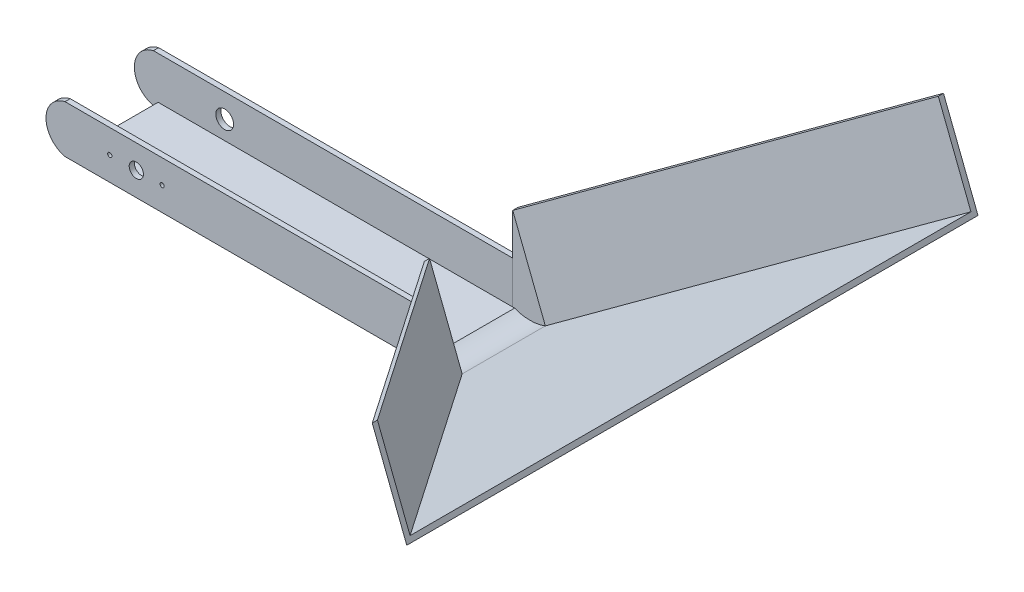
ISO-10303-21;
HEADER;
FILE_DESCRIPTION(('STEP AP214'),'2;1');
FILE_NAME('part.step','',(''),(''),'','','');
FILE_SCHEMA(('AUTOMOTIVE_DESIGN { 1 0 10303 214 1 1 1 1 }'));
ENDSEC;
DATA;
#1=APPLICATION_CONTEXT('core data for automotive mechanical design processes');
#2=APPLICATION_PROTOCOL_DEFINITION('international standard','automotive_design',2000,#1);
#3=PRODUCT_CONTEXT('',#1,'mechanical');
#4=PRODUCT('Part','Part','',(#3));
#5=PRODUCT_RELATED_PRODUCT_CATEGORY('part','',(#4));
#6=PRODUCT_DEFINITION_FORMATION('','',#4);
#7=PRODUCT_DEFINITION_CONTEXT('part definition',#1,'design');
#8=PRODUCT_DEFINITION('design','',#6,#7);
#9=PRODUCT_DEFINITION_SHAPE('','',#8);
#10=(LENGTH_UNIT() NAMED_UNIT(*) SI_UNIT(.MILLI.,.METRE.));
#11=(NAMED_UNIT(*) PLANE_ANGLE_UNIT() SI_UNIT($,.RADIAN.));
#12=(NAMED_UNIT(*) SI_UNIT($,.STERADIAN.) SOLID_ANGLE_UNIT());
#13=UNCERTAINTY_MEASURE_WITH_UNIT(LENGTH_MEASURE(1.E-05),#10,'distance_accuracy_value','');
#14=(GEOMETRIC_REPRESENTATION_CONTEXT(3) GLOBAL_UNCERTAINTY_ASSIGNED_CONTEXT((#13)) GLOBAL_UNIT_ASSIGNED_CONTEXT((#10,
#11,#12)) REPRESENTATION_CONTEXT('',''));
#15=CARTESIAN_POINT('',(0.,0.,0.));
#16=DIRECTION('',(0.,0.,1.));
#17=DIRECTION('',(1.,0.,0.));
#18=AXIS2_PLACEMENT_3D('',#15,#16,#17);
#19=CARTESIAN_POINT('',(99.0163790398225,18.6607266862626,28.6585677660098));
#20=DIRECTION('',(-0.363086708097829,0.931755355446204,0.));
#21=DIRECTION('',(0.931755355446204,0.363086708097829,0.));
#22=AXIS2_PLACEMENT_3D('',#19,#20,#21);
#23=PLANE('',#22);
#24=DIRECTION('',(-0.598920797739893,-0.233387637207156,-0.766044443118982));
#25=VECTOR('',#24,1.);
#26=CARTESIAN_POINT('',(99.0163790398225,18.6607266862626,28.6585677660098));
#27=LINE('',#26,#25);
#28=CARTESIAN_POINT('',(198.805962668012,57.5467617492555,156.293567766011));
#29=VERTEX_POINT('',#28);
#30=CARTESIAN_POINT('',(99.0163790398225,18.6607266862626,28.6585677660097));
#31=VERTEX_POINT('',#30);
#32=EDGE_CURVE('E106',#29,#31,#27,.T.);
#33=ORIENTED_EDGE('',*,*,#32,.T.);
#34=DIRECTION('',(0.,0.,1.));
#35=VECTOR('',#34,1.);
#36=CARTESIAN_POINT('',(99.0163790398225,18.6607266862627,-72.5875588624848));
#37=LINE('',#36,#35);
#38=CARTESIAN_POINT('',(99.0163790398225,18.6607266862626,31.4271677660097));
#39=VERTEX_POINT('',#38);
#40=EDGE_CURVE('E191',#31,#39,#37,.T.);
#41=ORIENTED_EDGE('',*,*,#40,.T.);
#42=DIRECTION('',(0.598920797739893,0.233387637207156,0.766044443118982));
#43=VECTOR('',#42,1.);
#44=CARTESIAN_POINT('',(97.7461455010847,18.1657416975529,29.8024865936655));
#45=LINE('',#44,#43);
#46=CARTESIAN_POINT('',(198.805962668012,57.5467617492555,159.062167766011));
#47=VERTEX_POINT('',#46);
#48=EDGE_CURVE('E108',#39,#47,#45,.T.);
#49=ORIENTED_EDGE('',*,*,#48,.T.);
#50=DIRECTION('',(0.,0.,-1.));
#51=VECTOR('',#50,1.);
#52=CARTESIAN_POINT('',(198.805962668012,57.5467617492555,28.6585677660098));
#53=LINE('',#52,#51);
#54=EDGE_CURVE('E70',#47,#29,#53,.T.);
#55=ORIENTED_EDGE('',*,*,#54,.T.);
#56=EDGE_LOOP('',(#33,#41,#49,#55));
#57=FACE_BOUND('',#56,.T.);
#58=ADVANCED_FACE('F46',(#57),#23,.T.);
#59=CARTESIAN_POINT('',(117.461183811192,-28.6724453704045,28.6585677660098));
#60=DIRECTION('',(-0.363086708097829,0.931755355446204,0.));
#61=DIRECTION('',(0.931755355446204,0.363086708097829,0.));
#62=AXIS2_PLACEMENT_3D('',#59,#60,#61);
#63=PLANE('',#62);
#64=DIRECTION('',(0.598920797739893,0.233387637207156,0.766044443118982));
#65=VECTOR('',#64,1.);
#66=CARTESIAN_POINT('',(116.190950272454,-29.1674303591143,29.8024865936655));
#67=LINE('',#66,#65);
#68=CARTESIAN_POINT('',(117.461183811192,-28.6724453704045,31.4271677660098));
#69=VERTEX_POINT('',#68);
#70=CARTESIAN_POINT('',(217.250767439382,10.2135896925883,159.062167766011));
#71=VERTEX_POINT('',#70);
#72=EDGE_CURVE('E83',#69,#71,#67,.T.);
#73=ORIENTED_EDGE('',*,*,#72,.F.);
#74=DIRECTION('',(0.,0.,1.));
#75=VECTOR('',#74,1.);
#76=CARTESIAN_POINT('',(117.461183811192,-28.6724453704045,28.6585677660098));
#77=LINE('',#76,#75);
#78=CARTESIAN_POINT('',(117.461183811192,-28.6724453704045,-18.5600322339902));
#79=VERTEX_POINT('',#78);
#80=EDGE_CURVE('E93',#79,#69,#77,.T.);
#81=ORIENTED_EDGE('',*,*,#80,.F.);
#82=DIRECTION('',(-0.598920797739899,-0.233387637207158,0.766044443118977));
#83=VECTOR('',#82,1.);
#84=CARTESIAN_POINT('',(95.7972925404252,-37.1144370585824,9.1489796870016));
#85=LINE('',#84,#83);
#86=CARTESIAN_POINT('',(217.250767439382,10.2135896925884,-146.195032233989));
#87=VERTEX_POINT('',#86);
#88=EDGE_CURVE('E105',#87,#79,#85,.T.);
#89=ORIENTED_EDGE('',*,*,#88,.F.);
#90=DIRECTION('',(0.,0.,-1.));
#91=VECTOR('',#90,1.);
#92=CARTESIAN_POINT('',(217.250767439382,10.2135896925884,28.6585677660098));
#93=LINE('',#92,#91);
#94=EDGE_CURVE('E92',#71,#87,#93,.T.);
#95=ORIENTED_EDGE('',*,*,#94,.F.);
#96=EDGE_LOOP('',(#73,#81,#89,#95));
#97=FACE_BOUND('',#96,.T.);
#98=ADVANCED_FACE('F103',(#97),#63,.F.);
#99=CARTESIAN_POINT('',(75.3497930114889,9.4383243005778,28.6585677660097));
#100=DIRECTION('',(0.,0.,-1.));
#101=DIRECTION('',(-0.931755355446204,-0.363086708097829,0.));
#102=AXIS2_PLACEMENT_3D('',#99,#100,#101);
#103=PLANE('',#102);
#104=DIRECTION('',(-0.363087079020477,-0.93175521090487,0.));
#105=VECTOR('',#104,1.);
#106=CARTESIAN_POINT('',(99.0163790398225,-28.6724175217377,28.6585677660097));
#107=LINE('',#106,#105);
#108=CARTESIAN_POINT('',(100.029467360769,-26.0726270673509,28.6585677660097));
#109=VERTEX_POINT('',#108);
#110=CARTESIAN_POINT('',(99.0163790398225,-28.6724175217377,28.6585677660097));
#111=VERTEX_POINT('',#110);
#112=EDGE_CURVE('E179',#109,#111,#107,.T.);
#113=ORIENTED_EDGE('',*,*,#112,.T.);
#114=DIRECTION('',(0.,1.,0.));
#115=VECTOR('',#114,1.);
#116=CARTESIAN_POINT('',(99.0163790398225,9.4383243005778,28.6585677660097));
#117=LINE('',#116,#115);
#118=EDGE_CURVE('E174',#111,#31,#117,.T.);
#119=ORIENTED_EDGE('',*,*,#118,.T.);
#120=DIRECTION('',(0.363086708097829,-0.931755355446204,0.));
#121=VECTOR('',#120,1.);
#122=CARTESIAN_POINT('',(99.0163790398225,18.6607266862626,28.6585677660098));
#123=LINE('',#122,#121);
#124=CARTESIAN_POINT('',(116.455941951153,-26.0927874933162,28.6585677660097));
#125=VERTEX_POINT('',#124);
#126=EDGE_CURVE('E12',#31,#125,#123,.T.);
#127=ORIENTED_EDGE('',*,*,#126,.T.);
#128=CARTESIAN_POINT('',(108.268479011951,-5.08206947203604,28.6585677660097));
#129=DIRECTION('',(0.,0.,1.));
#130=DIRECTION('',(0.931755355446204,0.363086708097829,0.));
#131=AXIS2_PLACEMENT_3D('',#128,#129,#130);
#132=CIRCLE('',#131,22.5496080043655);
#133=EDGE_CURVE('E167',#125,#109,#132,.F.);
#134=ORIENTED_EDGE('',*,*,#133,.T.);
#135=EDGE_LOOP('',(#113,#119,#127,#134));
#136=FACE_BOUND('',#135,.T.);
#137=ADVANCED_FACE('F266',(#136),#103,.T.);
#138=CARTESIAN_POINT('',(93.7945977828586,-37.8948477560894,31.4271677660097));
#139=DIRECTION('',(0.,0.,1.));
#140=DIRECTION('',(0.931755355446204,0.363086708097829,0.));
#141=AXIS2_PLACEMENT_3D('',#138,#139,#140);
#142=PLANE('',#141);
#143=DIRECTION('',(0.363086708097829,-0.931755355446204,0.));
#144=VECTOR('',#143,1.);
#145=CARTESIAN_POINT('',(99.0163790398225,18.6607266862626,31.4271677660098));
#146=LINE('',#145,#144);
#147=EDGE_CURVE('E54',#39,#69,#146,.T.);
#148=ORIENTED_EDGE('',*,*,#147,.F.);
#149=DIRECTION('',(0.,-1.,0.));
#150=VECTOR('',#149,1.);
#151=CARTESIAN_POINT('',(99.0163790398225,18.6607266862626,31.4271677660097));
#152=LINE('',#151,#150);
#153=CARTESIAN_POINT('',(99.0163790398225,-28.6724175217377,31.4271677660097));
#154=VERTEX_POINT('',#153);
#155=EDGE_CURVE('E194',#39,#154,#152,.T.);
#156=ORIENTED_EDGE('',*,*,#155,.T.);
#157=DIRECTION('',(0.99999999999886,-1.50983798186122E-06,0.));
#158=VECTOR('',#157,1.);
#159=CARTESIAN_POINT('',(99.0163790398225,-28.6724175217377,31.4271677660097));
#160=LINE('',#159,#158);
#161=EDGE_CURVE('E190',#154,#69,#160,.T.);
#162=ORIENTED_EDGE('',*,*,#161,.T.);
#163=EDGE_LOOP('',(#148,#156,#162));
#164=FACE_BOUND('',#163,.T.);
#165=ADVANCED_FACE('F201',(#164),#142,.T.);
#166=CARTESIAN_POINT('',(75.3497930114889,9.4383243005778,-15.7914322339902));
#167=DIRECTION('',(0.,0.,-1.));
#168=DIRECTION('',(-0.931755355446204,-0.363086708097829,0.));
#169=AXIS2_PLACEMENT_3D('',#166,#167,#168);
#170=PLANE('',#169);
#171=CARTESIAN_POINT('',(108.268479011951,-5.08206947203603,-15.7914322339902));
#172=DIRECTION('',(0.,0.,-1.));
#173=DIRECTION('',(-0.931755355446204,-0.363086708097829,0.));
#174=AXIS2_PLACEMENT_3D('',#171,#172,#173);
#175=CIRCLE('',#174,22.5496080043655);
#176=CARTESIAN_POINT('',(116.455941951153,-26.0927874933162,-15.7914322339902));
#177=VERTEX_POINT('',#176);
#178=CARTESIAN_POINT('',(100.029467360769,-26.0726270673509,-15.7914322339902));
#179=VERTEX_POINT('',#178);
#180=EDGE_CURVE('E173',#177,#179,#175,.T.);
#181=ORIENTED_EDGE('',*,*,#180,.F.);
#182=DIRECTION('',(0.363086708097829,-0.931755355446204,0.));
#183=VECTOR('',#182,1.);
#184=CARTESIAN_POINT('',(99.0163790398225,18.6607266862626,-15.7914322339902));
#185=LINE('',#184,#183);
#186=CARTESIAN_POINT('',(99.0163790398225,18.6607266862626,-15.7914322339902));
#187=VERTEX_POINT('',#186);
#188=EDGE_CURVE('E142',#187,#177,#185,.T.);
#189=ORIENTED_EDGE('',*,*,#188,.F.);
#190=DIRECTION('',(0.,1.,0.));
#191=VECTOR('',#190,1.);
#192=CARTESIAN_POINT('',(99.0163790398225,18.6607266862626,-15.7914322339902));
#193=LINE('',#192,#191);
#194=CARTESIAN_POINT('',(99.0163790398225,-28.6724175217377,-15.7914322339902));
#195=VERTEX_POINT('',#194);
#196=EDGE_CURVE('E148',#195,#187,#193,.T.);
#197=ORIENTED_EDGE('',*,*,#196,.F.);
#198=DIRECTION('',(-0.363087079020477,-0.93175521090487,0.));
#199=VECTOR('',#198,1.);
#200=CARTESIAN_POINT('',(99.0163790398225,-28.6724175217377,-15.7914322339902));
#201=LINE('',#200,#199);
#202=EDGE_CURVE('E178',#179,#195,#201,.T.);
#203=ORIENTED_EDGE('',*,*,#202,.F.);
#204=EDGE_LOOP('',(#181,#189,#197,#203));
#205=FACE_BOUND('',#204,.T.);
#206=ADVANCED_FACE('F259',(#205),#170,.F.);
#207=CARTESIAN_POINT('',(99.0163790398225,18.6607266862626,28.6585677660098));
#208=DIRECTION('',(-0.713766012385916,-0.278140555108706,0.642787609686535));
#209=DIRECTION('',(0.598920797739893,0.233387637207156,0.766044443118982));
#210=AXIS2_PLACEMENT_3D('',#207,#208,#209);
#211=PLANE('',#210);
#212=DIRECTION('',(0.363086708097829,-0.931755355446204,0.));
#213=VECTOR('',#212,1.);
#214=CARTESIAN_POINT('',(198.805962668012,57.5467617492555,156.293567766011));
#215=LINE('',#214,#213);
#216=CARTESIAN_POINT('',(216.245525579343,12.7932475696767,156.293567766011));
#217=VERTEX_POINT('',#216);
#218=EDGE_CURVE('E61',#29,#217,#215,.T.);
#219=ORIENTED_EDGE('',*,*,#218,.T.);
#220=DIRECTION('',(0.598920797739893,0.233387637207156,0.766044443118982));
#221=VECTOR('',#220,1.);
#222=CARTESIAN_POINT('',(116.455941951153,-26.0927874933162,28.6585677660098));
#223=LINE('',#222,#221);
#224=EDGE_CURVE('E132',#125,#217,#223,.T.);
#225=ORIENTED_EDGE('',*,*,#224,.F.);
#226=ORIENTED_EDGE('',*,*,#126,.F.);
#227=ORIENTED_EDGE('',*,*,#32,.F.);
#228=EDGE_LOOP('',(#219,#225,#226,#227));
#229=FACE_BOUND('',#228,.T.);
#230=ADVANCED_FACE('F48',(#229),#211,.F.);
#231=CARTESIAN_POINT('',(97.7461455010847,18.1657416975529,29.8024865936655));
#232=DIRECTION('',(0.713766012385916,0.278140555108706,-0.642787609686535));
#233=DIRECTION('',(-0.598920797739893,-0.233387637207156,-0.766044443118982));
#234=AXIS2_PLACEMENT_3D('',#231,#232,#233);
#235=PLANE('',#234);
#236=ORIENTED_EDGE('',*,*,#72,.T.);
#237=DIRECTION('',(0.363086708097829,-0.931755355446204,0.));
#238=VECTOR('',#237,1.);
#239=CARTESIAN_POINT('',(198.805962668012,57.5467617492555,159.062167766011));
#240=LINE('',#239,#238);
#241=EDGE_CURVE('E87',#47,#71,#240,.T.);
#242=ORIENTED_EDGE('',*,*,#241,.F.);
#243=ORIENTED_EDGE('',*,*,#48,.F.);
#244=ORIENTED_EDGE('',*,*,#147,.T.);
#245=EDGE_LOOP('',(#236,#242,#243,#244));
#246=FACE_BOUND('',#245,.T.);
#247=ADVANCED_FACE('F85',(#246),#235,.F.);
#248=CARTESIAN_POINT('',(198.805962668012,57.5467617492555,28.6585677660098));
#249=DIRECTION('',(-0.931755355446204,-0.363086708097829,0.));
#250=DIRECTION('',(0.,0.,1.));
#251=AXIS2_PLACEMENT_3D('',#248,#249,#250);
#252=PLANE('',#251);
#253=ORIENTED_EDGE('',*,*,#94,.T.);
#254=DIRECTION('',(0.363086708097829,-0.931755355446204,0.));
#255=VECTOR('',#254,1.);
#256=CARTESIAN_POINT('',(198.805962668013,57.5467617492556,-146.195032233989));
#257=LINE('',#256,#255);
#258=CARTESIAN_POINT('',(198.805962668013,57.5467617492556,-146.195032233989));
#259=VERTEX_POINT('',#258);
#260=EDGE_CURVE('E137',#259,#87,#257,.T.);
#261=ORIENTED_EDGE('',*,*,#260,.F.);
#262=DIRECTION('',(0.,0.,-1.));
#263=VECTOR('',#262,1.);
#264=CARTESIAN_POINT('',(198.805962668012,57.5467617492552,28.6585677660104));
#265=LINE('',#264,#263);
#266=CARTESIAN_POINT('',(198.805962668012,57.5467617492556,-143.426432233989));
#267=VERTEX_POINT('',#266);
#268=EDGE_CURVE('E151',#267,#259,#265,.T.);
#269=ORIENTED_EDGE('',*,*,#268,.F.);
#270=DIRECTION('',(0.363086708097829,-0.931755355446204,0.));
#271=VECTOR('',#270,1.);
#272=CARTESIAN_POINT('',(198.805962668012,57.5467617492556,-143.426432233989));
#273=LINE('',#272,#271);
#274=CARTESIAN_POINT('',(216.245525579343,12.7932475696767,-143.426432233989));
#275=VERTEX_POINT('',#274);
#276=EDGE_CURVE('E134',#267,#275,#273,.T.);
#277=ORIENTED_EDGE('',*,*,#276,.T.);
#278=DIRECTION('',(0.,0.,-1.));
#279=VECTOR('',#278,1.);
#280=CARTESIAN_POINT('',(216.245525579343,12.7932475696767,156.293567766011));
#281=LINE('',#280,#279);
#282=EDGE_CURVE('E127',#217,#275,#281,.T.);
#283=ORIENTED_EDGE('',*,*,#282,.F.);
#284=ORIENTED_EDGE('',*,*,#218,.F.);
#285=ORIENTED_EDGE('',*,*,#54,.F.);
#286=ORIENTED_EDGE('',*,*,#241,.T.);
#287=EDGE_LOOP('',(#253,#261,#269,#277,#283,#284,#285,#286));
#288=FACE_BOUND('',#287,.T.);
#289=ADVANCED_FACE('F97',(#288),#252,.F.);
#290=CARTESIAN_POINT('',(116.455941951153,-26.0927874933162,28.6585677660098));
#291=DIRECTION('',(-0.363086708097829,0.931755355446204,0.));
#292=DIRECTION('',(0.931755355446204,0.363086708097829,0.));
#293=AXIS2_PLACEMENT_3D('',#290,#291,#292);
#294=PLANE('',#293);
#295=ORIENTED_EDGE('',*,*,#224,.T.);
#296=ORIENTED_EDGE('',*,*,#282,.T.);
#297=DIRECTION('',(-0.598920797739898,-0.233387637207158,0.766044443118977));
#298=VECTOR('',#297,1.);
#299=CARTESIAN_POINT('',(116.455941951153,-26.0927874933161,-15.7914322339902));
#300=LINE('',#299,#298);
#301=EDGE_CURVE('E120',#275,#177,#300,.T.);
#302=ORIENTED_EDGE('',*,*,#301,.T.);
#303=DIRECTION('',(0.,0.,1.));
#304=VECTOR('',#303,1.);
#305=CARTESIAN_POINT('',(116.455941951153,-26.0927874933162,28.6585677660098));
#306=LINE('',#305,#304);
#307=EDGE_CURVE('E114',#177,#125,#306,.T.);
#308=ORIENTED_EDGE('',*,*,#307,.T.);
#309=EDGE_LOOP('',(#295,#296,#302,#308));
#310=FACE_BOUND('',#309,.T.);
#311=ADVANCED_FACE('F243',(#310),#294,.T.);
#312=CARTESIAN_POINT('',(78.6227213077934,10.7137199867945,10.2928985146573));
#313=DIRECTION('',(-0.713766012385912,-0.278140555108704,-0.64278760968654));
#314=DIRECTION('',(-0.598920797739899,-0.233387637207158,0.766044443118977));
#315=AXIS2_PLACEMENT_3D('',#312,#313,#314);
#316=PLANE('',#315);
#317=ORIENTED_EDGE('',*,*,#301,.F.);
#318=ORIENTED_EDGE('',*,*,#276,.F.);
#319=DIRECTION('',(0.598920797739899,0.233387637207158,-0.766044443118977));
#320=VECTOR('',#319,1.);
#321=CARTESIAN_POINT('',(78.6227213077934,10.7137199867945,10.2928985146573));
#322=LINE('',#321,#320);
#323=EDGE_CURVE('E147',#187,#267,#322,.T.);
#324=ORIENTED_EDGE('',*,*,#323,.F.);
#325=ORIENTED_EDGE('',*,*,#188,.T.);
#326=EDGE_LOOP('',(#317,#318,#324,#325));
#327=FACE_BOUND('',#326,.T.);
#328=ADVANCED_FACE('F246',(#327),#316,.F.);
#329=CARTESIAN_POINT('',(77.3524877690555,10.2187349980848,9.14897968700162));
#330=DIRECTION('',(0.713766012385912,0.278140555108704,0.64278760968654));
#331=DIRECTION('',(0.598920797739899,0.233387637207158,-0.766044443118977));
#332=AXIS2_PLACEMENT_3D('',#329,#330,#331);
#333=PLANE('',#332);
#334=ORIENTED_EDGE('',*,*,#88,.T.);
#335=DIRECTION('',(0.363086708097829,-0.931755355446204,0.));
#336=VECTOR('',#335,1.);
#337=CARTESIAN_POINT('',(99.0163790398225,18.6607266862626,-18.5600322339902));
#338=LINE('',#337,#336);
#339=CARTESIAN_POINT('',(99.0163790398225,18.6607266862626,-18.5600322339902));
#340=VERTEX_POINT('',#339);
#341=EDGE_CURVE('E139',#340,#79,#338,.T.);
#342=ORIENTED_EDGE('',*,*,#341,.F.);
#343=DIRECTION('',(-0.598920797739899,-0.233387637207158,0.766044443118977));
#344=VECTOR('',#343,1.);
#345=CARTESIAN_POINT('',(77.3524877690555,10.2187349980848,9.14897968700162));
#346=LINE('',#345,#344);
#347=EDGE_CURVE('E145',#259,#340,#346,.T.);
#348=ORIENTED_EDGE('',*,*,#347,.F.);
#349=ORIENTED_EDGE('',*,*,#260,.T.);
#350=EDGE_LOOP('',(#334,#342,#348,#349));
#351=FACE_BOUND('',#350,.T.);
#352=ADVANCED_FACE('F309',(#351),#333,.F.);
#353=CARTESIAN_POINT('',(99.0163790398225,18.6607266862626,28.6585677660098));
#354=DIRECTION('',(-0.363086708097829,0.931755355446204,0.));
#355=DIRECTION('',(0.931755355446204,0.363086708097829,0.));
#356=AXIS2_PLACEMENT_3D('',#353,#354,#355);
#357=PLANE('',#356);
#358=DIRECTION('',(0.,0.,-1.));
#359=VECTOR('',#358,1.);
#360=CARTESIAN_POINT('',(99.0163790398225,18.6607266862626,41.0046943945045));
#361=LINE('',#360,#359);
#362=EDGE_CURVE('E159',#187,#340,#361,.T.);
#363=ORIENTED_EDGE('',*,*,#362,.F.);
#364=ORIENTED_EDGE('',*,*,#323,.T.);
#365=ORIENTED_EDGE('',*,*,#268,.T.);
#366=ORIENTED_EDGE('',*,*,#347,.T.);
#367=EDGE_LOOP('',(#363,#364,#365,#366));
#368=FACE_BOUND('',#367,.T.);
#369=ADVANCED_FACE('F252',(#368),#357,.T.);
#370=CARTESIAN_POINT('',(93.7945977828586,-37.8948477560894,-18.5600322339902));
#371=DIRECTION('',(0.,0.,1.));
#372=DIRECTION('',(0.931755355446204,0.363086708097829,0.));
#373=AXIS2_PLACEMENT_3D('',#370,#371,#372);
#374=PLANE('',#373);
#375=DIRECTION('',(0.99999999999886,-1.50983798186122E-06,0.));
#376=VECTOR('',#375,1.);
#377=CARTESIAN_POINT('',(99.0163790398225,-28.6724175217377,-18.5600322339902));
#378=LINE('',#377,#376);
#379=CARTESIAN_POINT('',(99.0163790398225,-28.6724175217377,-18.5600322339902));
#380=VERTEX_POINT('',#379);
#381=EDGE_CURVE('E160',#380,#79,#378,.T.);
#382=ORIENTED_EDGE('',*,*,#381,.F.);
#383=DIRECTION('',(0.,-1.,0.));
#384=VECTOR('',#383,1.);
#385=CARTESIAN_POINT('',(99.0163790398225,18.6607266862626,-18.5600322339902));
#386=LINE('',#385,#384);
#387=EDGE_CURVE('E164',#340,#380,#386,.T.);
#388=ORIENTED_EDGE('',*,*,#387,.F.);
#389=ORIENTED_EDGE('',*,*,#341,.T.);
#390=EDGE_LOOP('',(#382,#388,#389));
#391=FACE_BOUND('',#390,.T.);
#392=ADVANCED_FACE('F303',(#391),#374,.F.);
#393=CARTESIAN_POINT('',(99.0163790398225,18.6607266862626,41.0046943945045));
#394=DIRECTION('',(1.,0.,0.));
#395=DIRECTION('',(0.,-1.,0.));
#396=AXIS2_PLACEMENT_3D('',#393,#394,#395);
#397=PLANE('',#396);
#398=ORIENTED_EDGE('',*,*,#196,.T.);
#399=ORIENTED_EDGE('',*,*,#362,.T.);
#400=ORIENTED_EDGE('',*,*,#387,.T.);
#401=DIRECTION('',(0.,0.,-1.));
#402=VECTOR('',#401,1.);
#403=CARTESIAN_POINT('',(99.0163790398225,-28.6724175217377,41.0046943945045));
#404=LINE('',#403,#402);
#405=EDGE_CURVE('E156',#195,#380,#404,.T.);
#406=ORIENTED_EDGE('',*,*,#405,.F.);
#407=EDGE_LOOP('',(#398,#399,#400,#406));
#408=FACE_BOUND('',#407,.T.);
#409=ADVANCED_FACE('F301',(#408),#397,.F.);
#410=CARTESIAN_POINT('',(99.0163790398225,-28.6724175217377,41.0046943945045));
#411=DIRECTION('',(1.50983798186122E-06,0.99999999999886,0.));
#412=DIRECTION('',(0.99999999999886,-1.50983798186122E-06,0.));
#413=AXIS2_PLACEMENT_3D('',#410,#411,#412);
#414=PLANE('',#413);
#415=ORIENTED_EDGE('',*,*,#80,.T.);
#416=ORIENTED_EDGE('',*,*,#161,.F.);
#417=DIRECTION('',(0.,0.,1.));
#418=VECTOR('',#417,1.);
#419=CARTESIAN_POINT('',(99.0163790398225,-28.6724175217377,-72.5875588624848));
#420=LINE('',#419,#418);
#421=EDGE_CURVE('E195',#111,#154,#420,.T.);
#422=ORIENTED_EDGE('',*,*,#421,.F.);
#423=DIRECTION('',(0.,0.,-1.));
#424=VECTOR('',#423,1.);
#425=CARTESIAN_POINT('',(99.0163790398225,-28.6724175217377,47.9445900306164));
#426=LINE('',#425,#424);
#427=EDGE_CURVE('E170',#111,#195,#426,.T.);
#428=ORIENTED_EDGE('',*,*,#427,.T.);
#429=ORIENTED_EDGE('',*,*,#405,.T.);
#430=ORIENTED_EDGE('',*,*,#381,.T.);
#431=EDGE_LOOP('',(#415,#416,#422,#428,#429,#430));
#432=FACE_BOUND('',#431,.T.);
#433=ADVANCED_FACE('F206',(#432),#414,.F.);
#434=CARTESIAN_POINT('',(108.268479011951,-5.08206947203604,47.9445900306164));
#435=DIRECTION('',(0.,0.,-1.));
#436=DIRECTION('',(-0.931755355446204,-0.363086708097829,0.));
#437=AXIS2_PLACEMENT_3D('',#434,#435,#436);
#438=CYLINDRICAL_SURFACE('',#437,22.5496080043655);
#439=ORIENTED_EDGE('',*,*,#133,.F.);
#440=ORIENTED_EDGE('',*,*,#307,.F.);
#441=ORIENTED_EDGE('',*,*,#180,.T.);
#442=DIRECTION('',(0.,0.,-1.));
#443=VECTOR('',#442,1.);
#444=CARTESIAN_POINT('',(100.029467360769,-26.0726270673509,47.9445900306164));
#445=LINE('',#444,#443);
#446=EDGE_CURVE('E175',#109,#179,#445,.T.);
#447=ORIENTED_EDGE('',*,*,#446,.F.);
#448=EDGE_LOOP('',(#439,#440,#441,#447));
#449=FACE_BOUND('',#448,.T.);
#450=ADVANCED_FACE('F262',(#449),#438,.F.);
#451=CARTESIAN_POINT('',(99.0163790398225,-28.6724175217377,47.9445900306164));
#452=DIRECTION('',(0.93175521090487,-0.363087079020477,0.));
#453=DIRECTION('',(-0.363087079020477,-0.93175521090487,0.));
#454=AXIS2_PLACEMENT_3D('',#451,#452,#453);
#455=PLANE('',#454);
#456=ORIENTED_EDGE('',*,*,#112,.F.);
#457=ORIENTED_EDGE('',*,*,#446,.T.);
#458=ORIENTED_EDGE('',*,*,#202,.T.);
#459=ORIENTED_EDGE('',*,*,#427,.F.);
#460=EDGE_LOOP('',(#456,#457,#458,#459));
#461=FACE_BOUND('',#460,.T.);
#462=ADVANCED_FACE('F269',(#461),#455,.F.);
#463=CARTESIAN_POINT('',(99.0163790398225,18.6607266862627,-72.5875588624848));
#464=DIRECTION('',(-1.,0.,0.));
#465=DIRECTION('',(0.,1.,0.));
#466=AXIS2_PLACEMENT_3D('',#463,#464,#465);
#467=PLANE('',#466);
#468=ORIENTED_EDGE('',*,*,#421,.T.);
#469=ORIENTED_EDGE('',*,*,#155,.F.);
#470=ORIENTED_EDGE('',*,*,#40,.F.);
#471=ORIENTED_EDGE('',*,*,#118,.F.);
#472=EDGE_LOOP('',(#468,#469,#470,#471));
#473=FACE_BOUND('',#472,.T.);
#474=ADVANCED_FACE('F267',(#473),#467,.T.);
#475=CLOSED_SHELL('',(#58,#98,#137,#165,#206,#230,#247,#289,#311,#328,#352,#369,#392,#409,#433,
#450,#462,#474));
#476=MANIFOLD_SOLID_BREP('B2',#475);
#477=CARTESIAN_POINT('',(-90.1530320109,-16.1412270673509,31.4271677660097));
#478=DIRECTION('',(0.,0.,-1.));
#479=DIRECTION('',(-1.,0.,0.));
#480=AXIS2_PLACEMENT_3D('',#477,#478,#479);
#481=PLANE('',#480);
#482=CARTESIAN_POINT('',(-41.1178794585354,-16.1412265646858,31.4271677660097));
#483=DIRECTION('',(0.,0.,1.));
#484=DIRECTION('',(1.,0.,0.));
#485=AXIS2_PLACEMENT_3D('',#482,#483,#484);
#486=CIRCLE('',#485,1.13029999999999);
#487=CARTESIAN_POINT('',(-39.9875794585354,-16.1412265646858,31.4271677660097));
#488=VERTEX_POINT('',#487);
#489=EDGE_CURVE('E592',#488,#488,#486,.T.);
#490=ORIENTED_EDGE('',*,*,#489,.F.);
#491=EDGE_LOOP('',(#490));
#492=FACE_BOUND('',#491,.T.);
#493=CARTESIAN_POINT('',(-90.1530320109,-16.1412270673509,31.4271677660097));
#494=DIRECTION('',(0.,0.,-1.));
#495=DIRECTION('',(-1.,0.,0.));
#496=AXIS2_PLACEMENT_3D('',#493,#494,#495);
#497=CIRCLE('',#496,13.0175001379264);
#498=CARTESIAN_POINT('',(-93.0105326392311,-28.8412270673509,31.4271677660097));
#499=VERTEX_POINT('',#498);
#500=CARTESIAN_POINT('',(-93.0105326392311,-3.44122706735089,31.4271677660097));
#501=VERTEX_POINT('',#500);
#502=EDGE_CURVE('E504',#499,#501,#497,.T.);
#503=ORIENTED_EDGE('',*,*,#502,.F.);
#504=DIRECTION('',(-1.,0.,0.));
#505=VECTOR('',#504,1.);
#506=CARTESIAN_POINT('',(100.029467360769,-28.8412270673509,31.4271677660097));
#507=LINE('',#506,#505);
#508=CARTESIAN_POINT('',(100.029467360769,-28.8412270673509,31.4271677660097));
#509=VERTEX_POINT('',#508);
#510=EDGE_CURVE('E489',#509,#499,#507,.T.);
#511=ORIENTED_EDGE('',*,*,#510,.F.);
#512=DIRECTION('',(0.,-1.,0.));
#513=VECTOR('',#512,1.);
#514=CARTESIAN_POINT('',(100.029467360769,-28.8412270673509,31.4271677660097));
#515=LINE('',#514,#513);
#516=CARTESIAN_POINT('',(100.029467360769,-3.44122706735089,31.4271677660097));
#517=VERTEX_POINT('',#516);
#518=EDGE_CURVE('E477',#517,#509,#515,.T.);
#519=ORIENTED_EDGE('',*,*,#518,.F.);
#520=DIRECTION('',(-1.,0.,0.));
#521=VECTOR('',#520,1.);
#522=CARTESIAN_POINT('',(100.029467360769,-3.44122706735089,31.4271677660097));
#523=LINE('',#522,#521);
#524=EDGE_CURVE('E499',#517,#501,#523,.T.);
#525=ORIENTED_EDGE('',*,*,#524,.T.);
#526=EDGE_LOOP('',(#503,#511,#519,#525));
#527=FACE_BOUND('',#526,.T.);
#528=CARTESIAN_POINT('',(-69.0781994585354,-16.1412265646858,31.4271677660097));
#529=DIRECTION('',(0.,0.,1.));
#530=DIRECTION('',(1.,0.,0.));
#531=AXIS2_PLACEMENT_3D('',#528,#529,#530);
#532=CIRCLE('',#531,1.13029999999999);
#533=CARTESIAN_POINT('',(-67.9478994585354,-16.1412265646858,31.4271677660097));
#534=VERTEX_POINT('',#533);
#535=EDGE_CURVE('E586',#534,#534,#532,.T.);
#536=ORIENTED_EDGE('',*,*,#535,.F.);
#537=EDGE_LOOP('',(#536));
#538=FACE_BOUND('',#537,.T.);
#539=CARTESIAN_POINT('',(-54.9105326392313,-16.1412265646858,31.4271677660097));
#540=DIRECTION('',(0.,0.,1.));
#541=DIRECTION('',(1.,0.,0.));
#542=AXIS2_PLACEMENT_3D('',#539,#540,#541);
#543=CIRCLE('',#542,3.81000000000001);
#544=CARTESIAN_POINT('',(-51.1005326392313,-16.1412265646858,31.4271677660097));
#545=VERTEX_POINT('',#544);
#546=EDGE_CURVE('E595',#545,#545,#543,.T.);
#547=ORIENTED_EDGE('',*,*,#546,.F.);
#548=EDGE_LOOP('',(#547));
#549=FACE_BOUND('',#548,.T.);
#550=ADVANCED_FACE('F451',(#492,#527,#538,#549),#481,.F.);
#551=CARTESIAN_POINT('',(0.,-26.0726270673509,0.));
#552=DIRECTION('',(0.,1.,0.));
#553=DIRECTION('',(0.,0.,1.));
#554=AXIS2_PLACEMENT_3D('',#551,#552,#553);
#555=PLANE('',#554);
#556=DIRECTION('',(-1.,0.,0.));
#557=VECTOR('',#556,1.);
#558=CARTESIAN_POINT('',(100.029467360769,-26.0726270673509,-15.7914322339903));
#559=LINE('',#558,#557);
#560=CARTESIAN_POINT('',(100.029467360769,-26.0726270673509,-15.7914322339903));
#561=VERTEX_POINT('',#560);
#562=CARTESIAN_POINT('',(-90.4705326392311,-26.0726270673509,-15.7914322339903));
#563=VERTEX_POINT('',#562);
#564=EDGE_CURVE('E521',#561,#563,#559,.T.);
#565=ORIENTED_EDGE('',*,*,#564,.T.);
#566=DIRECTION('',(0.,0.,-1.));
#567=VECTOR('',#566,1.);
#568=CARTESIAN_POINT('',(-90.4705326392311,-26.0726270673509,28.6585677660097));
#569=LINE('',#568,#567);
#570=CARTESIAN_POINT('',(-90.4705326392311,-26.0726270673509,28.6585677660097));
#571=VERTEX_POINT('',#570);
#572=EDGE_CURVE('E539',#571,#563,#569,.T.);
#573=ORIENTED_EDGE('',*,*,#572,.F.);
#574=DIRECTION('',(1.,0.,0.));
#575=VECTOR('',#574,1.);
#576=CARTESIAN_POINT('',(-93.0105326392311,-26.0726270673509,28.6585677660097));
#577=LINE('',#576,#575);
#578=CARTESIAN_POINT('',(100.029467360769,-26.0726270673509,28.6585677660097));
#579=VERTEX_POINT('',#578);
#580=EDGE_CURVE('E525',#571,#579,#577,.T.);
#581=ORIENTED_EDGE('',*,*,#580,.T.);
#582=DIRECTION('',(0.,0.,-1.));
#583=VECTOR('',#582,1.);
#584=CARTESIAN_POINT('',(100.029467360769,-26.0726270673509,28.6585677660097));
#585=LINE('',#584,#583);
#586=EDGE_CURVE('E529',#579,#561,#585,.T.);
#587=ORIENTED_EDGE('',*,*,#586,.T.);
#588=EDGE_LOOP('',(#565,#573,#581,#587));
#589=FACE_BOUND('',#588,.T.);
#590=ADVANCED_FACE('F642',(#589),#555,.T.);
#591=CARTESIAN_POINT('',(-90.1530320109,-16.1412270673509,31.4271677660097));
#592=DIRECTION('',(0.,0.,-1.));
#593=DIRECTION('',(-1.,0.,0.));
#594=AXIS2_PLACEMENT_3D('',#591,#592,#593);
#595=CYLINDRICAL_SURFACE('',#594,13.0175001379264);
#596=CARTESIAN_POINT('',(-90.1530320109,-16.1412270673509,28.6585677660097));
#597=DIRECTION('',(0.,0.,-1.));
#598=DIRECTION('',(-1.,0.,0.));
#599=AXIS2_PLACEMENT_3D('',#596,#597,#598);
#600=CIRCLE('',#599,13.0175001379264);
#601=CARTESIAN_POINT('',(-93.0105326392311,-28.8412270673509,28.6585677660097));
#602=VERTEX_POINT('',#601);
#603=CARTESIAN_POINT('',(-93.0105326392311,-3.44122706735089,28.6585677660097));
#604=VERTEX_POINT('',#603);
#605=EDGE_CURVE('E506',#602,#604,#600,.T.);
#606=ORIENTED_EDGE('',*,*,#605,.F.);
#607=DIRECTION('',(0.,0.,-1.));
#608=VECTOR('',#607,1.);
#609=CARTESIAN_POINT('',(-93.0105326392311,-28.8412270673509,31.4271677660097));
#610=LINE('',#609,#608);
#611=EDGE_CURVE('E44',#499,#602,#610,.T.);
#612=ORIENTED_EDGE('',*,*,#611,.F.);
#613=ORIENTED_EDGE('',*,*,#502,.T.);
#614=DIRECTION('',(0.,0.,-1.));
#615=VECTOR('',#614,1.);
#616=CARTESIAN_POINT('',(-93.0105326392311,-3.44122706735089,31.4271677660097));
#617=LINE('',#616,#615);
#618=EDGE_CURVE('E460',#501,#604,#617,.T.);
#619=ORIENTED_EDGE('',*,*,#618,.T.);
#620=EDGE_LOOP('',(#606,#612,#613,#619));
#621=FACE_BOUND('',#620,.T.);
#622=ADVANCED_FACE('F453',(#621),#595,.T.);
#623=CARTESIAN_POINT('',(-90.1530320109,-16.1412270673509,28.6585677660097));
#624=DIRECTION('',(0.,0.,-1.));
#625=DIRECTION('',(-1.,0.,0.));
#626=AXIS2_PLACEMENT_3D('',#623,#624,#625);
#627=PLANE('',#626);
#628=CARTESIAN_POINT('',(-54.9105326392313,-16.1412265646858,28.6585677660097));
#629=DIRECTION('',(0.,0.,-1.));
#630=DIRECTION('',(-1.,0.,0.));
#631=AXIS2_PLACEMENT_3D('',#628,#629,#630);
#632=CIRCLE('',#631,3.81000000000001);
#633=CARTESIAN_POINT('',(-58.7205326392314,-16.1412265646858,28.6585677660097));
#634=VERTEX_POINT('',#633);
#635=EDGE_CURVE('E455',#634,#634,#632,.T.);
#636=ORIENTED_EDGE('',*,*,#635,.F.);
#637=EDGE_LOOP('',(#636));
#638=FACE_BOUND('',#637,.T.);
#639=CARTESIAN_POINT('',(-41.1178794585354,-16.1412265646858,28.6585677660097));
#640=DIRECTION('',(0.,0.,-1.));
#641=DIRECTION('',(-1.,0.,0.));
#642=AXIS2_PLACEMENT_3D('',#639,#640,#641);
#643=CIRCLE('',#642,1.13029999999999);
#644=CARTESIAN_POINT('',(-42.2481794585354,-16.1412265646858,28.6585677660097));
#645=VERTEX_POINT('',#644);
#646=EDGE_CURVE('E589',#645,#645,#643,.T.);
#647=ORIENTED_EDGE('',*,*,#646,.F.);
#648=EDGE_LOOP('',(#647));
#649=FACE_BOUND('',#648,.T.);
#650=CARTESIAN_POINT('',(-69.0781994585354,-16.1412265646858,28.6585677660097));
#651=DIRECTION('',(0.,0.,-1.));
#652=DIRECTION('',(-1.,0.,0.));
#653=AXIS2_PLACEMENT_3D('',#650,#651,#652);
#654=CIRCLE('',#653,1.13029999999999);
#655=CARTESIAN_POINT('',(-70.2084994585354,-16.1412265646858,28.6585677660097));
#656=VERTEX_POINT('',#655);
#657=EDGE_CURVE('E583',#656,#656,#654,.T.);
#658=ORIENTED_EDGE('',*,*,#657,.F.);
#659=EDGE_LOOP('',(#658));
#660=FACE_BOUND('',#659,.T.);
#661=DIRECTION('',(-1.,0.,0.));
#662=VECTOR('',#661,1.);
#663=CARTESIAN_POINT('',(-90.4705326392311,-28.8412270673509,28.6585677660097));
#664=LINE('',#663,#662);
#665=CARTESIAN_POINT('',(-90.4705326392311,-28.8412270673509,28.6585677660097));
#666=VERTEX_POINT('',#665);
#667=EDGE_CURVE('E526',#666,#602,#664,.T.);
#668=ORIENTED_EDGE('',*,*,#667,.T.);
#669=ORIENTED_EDGE('',*,*,#605,.T.);
#670=DIRECTION('',(1.,0.,0.));
#671=VECTOR('',#670,1.);
#672=CARTESIAN_POINT('',(-93.0105326392311,-3.44122706735089,28.6585677660097));
#673=LINE('',#672,#671);
#674=CARTESIAN_POINT('',(100.029467360769,-3.44122706735089,28.6585677660097));
#675=VERTEX_POINT('',#674);
#676=EDGE_CURVE('E522',#604,#675,#673,.T.);
#677=ORIENTED_EDGE('',*,*,#676,.T.);
#678=DIRECTION('',(0.,1.,0.));
#679=VECTOR('',#678,1.);
#680=CARTESIAN_POINT('',(100.029467360769,-26.0726270673509,28.6585677660097));
#681=LINE('',#680,#679);
#682=EDGE_CURVE('E518',#579,#675,#681,.T.);
#683=ORIENTED_EDGE('',*,*,#682,.F.);
#684=ORIENTED_EDGE('',*,*,#580,.F.);
#685=DIRECTION('',(0.,1.,0.));
#686=VECTOR('',#685,1.);
#687=CARTESIAN_POINT('',(-90.4705326392311,-28.8412270673509,28.6585677660097));
#688=LINE('',#687,#686);
#689=EDGE_CURVE('E468',#666,#571,#688,.T.);
#690=ORIENTED_EDGE('',*,*,#689,.F.);
#691=EDGE_LOOP('',(#668,#669,#677,#683,#684,#690));
#692=FACE_BOUND('',#691,.T.);
#693=ADVANCED_FACE('F604',(#638,#649,#660,#692),#627,.T.);
#694=CARTESIAN_POINT('',(100.029467360769,-3.44122706735089,31.4271677660097));
#695=DIRECTION('',(0.,-1.,0.));
#696=DIRECTION('',(0.,0.,-1.));
#697=AXIS2_PLACEMENT_3D('',#694,#695,#696);
#698=PLANE('',#697);
#699=DIRECTION('',(0.,0.,1.));
#700=VECTOR('',#699,1.);
#701=CARTESIAN_POINT('',(100.029467360769,-3.44122706735089,31.4271677660097));
#702=LINE('',#701,#700);
#703=EDGE_CURVE('E516',#675,#517,#702,.T.);
#704=ORIENTED_EDGE('',*,*,#703,.F.);
#705=ORIENTED_EDGE('',*,*,#676,.F.);
#706=ORIENTED_EDGE('',*,*,#618,.F.);
#707=ORIENTED_EDGE('',*,*,#524,.F.);
#708=EDGE_LOOP('',(#704,#705,#706,#707));
#709=FACE_BOUND('',#708,.T.);
#710=ADVANCED_FACE('F607',(#709),#698,.F.);
#711=CARTESIAN_POINT('',(100.029467360769,-28.8412270673509,-15.7914322339903));
#712=DIRECTION('',(0.,1.,0.));
#713=DIRECTION('',(0.,0.,1.));
#714=AXIS2_PLACEMENT_3D('',#711,#712,#713);
#715=PLANE('',#714);
#716=ORIENTED_EDGE('',*,*,#611,.T.);
#717=ORIENTED_EDGE('',*,*,#667,.F.);
#718=DIRECTION('',(0.,0.,1.));
#719=VECTOR('',#718,1.);
#720=CARTESIAN_POINT('',(-90.4705326392311,-28.8412270673509,-15.7914322339903));
#721=LINE('',#720,#719);
#722=CARTESIAN_POINT('',(-90.4705326392311,-28.8412270673509,-15.7914322339903));
#723=VERTEX_POINT('',#722);
#724=EDGE_CURVE('E542',#723,#666,#721,.T.);
#725=ORIENTED_EDGE('',*,*,#724,.F.);
#726=DIRECTION('',(-1.,0.,0.));
#727=VECTOR('',#726,1.);
#728=CARTESIAN_POINT('',(-93.0105326392311,-28.8412270673509,-15.7914322339903));
#729=LINE('',#728,#727);
#730=CARTESIAN_POINT('',(-93.0105326392311,-28.8412270673509,-15.7914322339903));
#731=VERTEX_POINT('',#730);
#732=EDGE_CURVE('E564',#723,#731,#729,.T.);
#733=ORIENTED_EDGE('',*,*,#732,.T.);
#734=DIRECTION('',(0.,0.,1.));
#735=VECTOR('',#734,1.);
#736=CARTESIAN_POINT('',(-93.0105326392311,-28.8412270673509,-18.5600322339903));
#737=LINE('',#736,#735);
#738=CARTESIAN_POINT('',(-93.0105326392311,-28.8412270673509,-18.5600322339903));
#739=VERTEX_POINT('',#738);
#740=EDGE_CURVE('E544',#739,#731,#737,.T.);
#741=ORIENTED_EDGE('',*,*,#740,.F.);
#742=DIRECTION('',(-1.,0.,0.));
#743=VECTOR('',#742,1.);
#744=CARTESIAN_POINT('',(-93.0105326392311,-28.8412270673509,-18.5600322339903));
#745=LINE('',#744,#743);
#746=CARTESIAN_POINT('',(100.029467360769,-28.8412270673509,-18.5600322339903));
#747=VERTEX_POINT('',#746);
#748=EDGE_CURVE('E557',#747,#739,#745,.T.);
#749=ORIENTED_EDGE('',*,*,#748,.F.);
#750=DIRECTION('',(0.,0.,-1.));
#751=VECTOR('',#750,1.);
#752=CARTESIAN_POINT('',(100.029467360769,-28.8412270673509,-15.7914322339903));
#753=LINE('',#752,#751);
#754=EDGE_CURVE('E496',#509,#747,#753,.T.);
#755=ORIENTED_EDGE('',*,*,#754,.F.);
#756=ORIENTED_EDGE('',*,*,#510,.T.);
#757=EDGE_LOOP('',(#716,#717,#725,#733,#741,#749,#755,#756));
#758=FACE_BOUND('',#757,.T.);
#759=ADVANCED_FACE('F491',(#758),#715,.F.);
#760=CARTESIAN_POINT('',(100.029467360769,0.,0.));
#761=DIRECTION('',(-1.,0.,0.));
#762=DIRECTION('',(0.,0.,1.));
#763=AXIS2_PLACEMENT_3D('',#760,#761,#762);
#764=PLANE('',#763);
#765=ORIENTED_EDGE('',*,*,#586,.F.);
#766=ORIENTED_EDGE('',*,*,#682,.T.);
#767=ORIENTED_EDGE('',*,*,#703,.T.);
#768=ORIENTED_EDGE('',*,*,#518,.T.);
#769=ORIENTED_EDGE('',*,*,#754,.T.);
#770=DIRECTION('',(0.,-1.,0.));
#771=VECTOR('',#770,1.);
#772=CARTESIAN_POINT('',(100.029467360769,-28.8412270673509,-18.5600322339903));
#773=LINE('',#772,#771);
#774=CARTESIAN_POINT('',(100.029467360769,-3.44122706735089,-18.5600322339903));
#775=VERTEX_POINT('',#774);
#776=EDGE_CURVE('E553',#775,#747,#773,.T.);
#777=ORIENTED_EDGE('',*,*,#776,.F.);
#778=DIRECTION('',(0.,0.,1.));
#779=VECTOR('',#778,1.);
#780=CARTESIAN_POINT('',(100.029467360769,-3.44122706735089,-18.5600322339903));
#781=LINE('',#780,#779);
#782=CARTESIAN_POINT('',(100.029467360769,-3.44122706735089,-15.7914322339903));
#783=VERTEX_POINT('',#782);
#784=EDGE_CURVE('E550',#775,#783,#781,.T.);
#785=ORIENTED_EDGE('',*,*,#784,.T.);
#786=DIRECTION('',(0.,-1.,0.));
#787=VECTOR('',#786,1.);
#788=CARTESIAN_POINT('',(100.029467360769,-28.8412270673509,-15.7914322339903));
#789=LINE('',#788,#787);
#790=EDGE_CURVE('E554',#783,#561,#789,.T.);
#791=ORIENTED_EDGE('',*,*,#790,.T.);
#792=EDGE_LOOP('',(#765,#766,#767,#768,#769,#777,#785,#791));
#793=FACE_BOUND('',#792,.T.);
#794=ADVANCED_FACE('F633',(#793),#764,.F.);
#795=CARTESIAN_POINT('',(-90.4705326392311,0.,0.));
#796=DIRECTION('',(-1.,0.,0.));
#797=DIRECTION('',(0.,0.,1.));
#798=AXIS2_PLACEMENT_3D('',#795,#796,#797);
#799=PLANE('',#798);
#800=ORIENTED_EDGE('',*,*,#724,.T.);
#801=ORIENTED_EDGE('',*,*,#689,.T.);
#802=ORIENTED_EDGE('',*,*,#572,.T.);
#803=DIRECTION('',(0.,-1.,0.));
#804=VECTOR('',#803,1.);
#805=CARTESIAN_POINT('',(-90.4705326392311,-26.0726270673509,-15.7914322339903));
#806=LINE('',#805,#804);
#807=EDGE_CURVE('E536',#563,#723,#806,.T.);
#808=ORIENTED_EDGE('',*,*,#807,.T.);
#809=EDGE_LOOP('',(#800,#801,#802,#808));
#810=FACE_BOUND('',#809,.T.);
#811=ADVANCED_FACE('F677',(#810),#799,.T.);
#812=CARTESIAN_POINT('',(-90.1530320109,-16.1412265646858,-15.7914322339903));
#813=DIRECTION('',(0.,0.,1.));
#814=DIRECTION('',(1.,0.,0.));
#815=AXIS2_PLACEMENT_3D('',#812,#813,#814);
#816=PLANE('',#815);
#817=CARTESIAN_POINT('',(-54.9105326392313,-16.1412265646858,-15.7914322339903));
#818=DIRECTION('',(0.,0.,1.));
#819=DIRECTION('',(1.,0.,0.));
#820=AXIS2_PLACEMENT_3D('',#817,#818,#819);
#821=CIRCLE('',#820,4.76249999999998);
#822=CARTESIAN_POINT('',(-50.1480326392314,-16.1412265646858,-15.7914322339903));
#823=VERTEX_POINT('',#822);
#824=EDGE_CURVE('E580',#823,#823,#821,.T.);
#825=ORIENTED_EDGE('',*,*,#824,.F.);
#826=EDGE_LOOP('',(#825));
#827=FACE_BOUND('',#826,.T.);
#828=ORIENTED_EDGE('',*,*,#807,.F.);
#829=ORIENTED_EDGE('',*,*,#564,.F.);
#830=ORIENTED_EDGE('',*,*,#790,.F.);
#831=DIRECTION('',(1.,0.,0.));
#832=VECTOR('',#831,1.);
#833=CARTESIAN_POINT('',(100.029467360769,-3.44122706735089,-15.7914322339903));
#834=LINE('',#833,#832);
#835=CARTESIAN_POINT('',(-93.0105371073609,-3.44122706735089,-15.7914322339903));
#836=VERTEX_POINT('',#835);
#837=EDGE_CURVE('E558',#836,#783,#834,.T.);
#838=ORIENTED_EDGE('',*,*,#837,.F.);
#839=CARTESIAN_POINT('',(-90.1530320109,-16.1412265646858,-15.7914322339903));
#840=DIRECTION('',(0.,0.,-1.));
#841=DIRECTION('',(1.,0.,0.));
#842=AXIS2_PLACEMENT_3D('',#839,#840,#841);
#843=CIRCLE('',#842,13.0175006283313);
#844=EDGE_CURVE('E561',#731,#836,#843,.T.);
#845=ORIENTED_EDGE('',*,*,#844,.F.);
#846=ORIENTED_EDGE('',*,*,#732,.F.);
#847=EDGE_LOOP('',(#828,#829,#830,#838,#845,#846));
#848=FACE_BOUND('',#847,.T.);
#849=ADVANCED_FACE('F673',(#827,#848),#816,.T.);
#850=CARTESIAN_POINT('',(-90.1530320109,-16.1412265646858,-18.5600322339903));
#851=DIRECTION('',(0.,0.,1.));
#852=DIRECTION('',(1.,0.,0.));
#853=AXIS2_PLACEMENT_3D('',#850,#851,#852);
#854=CYLINDRICAL_SURFACE('',#853,13.0175006283313);
#855=ORIENTED_EDGE('',*,*,#844,.T.);
#856=DIRECTION('',(0.,0.,1.));
#857=VECTOR('',#856,1.);
#858=CARTESIAN_POINT('',(-93.0105371073609,-3.44122706735089,-18.5600322339903));
#859=LINE('',#858,#857);
#860=CARTESIAN_POINT('',(-93.0105371073609,-3.44122706735089,-18.5600322339903));
#861=VERTEX_POINT('',#860);
#862=EDGE_CURVE('E547',#861,#836,#859,.T.);
#863=ORIENTED_EDGE('',*,*,#862,.F.);
#864=CARTESIAN_POINT('',(-90.1530320109,-16.1412265646858,-18.5600322339903));
#865=DIRECTION('',(0.,0.,-1.));
#866=DIRECTION('',(1.,0.,0.));
#867=AXIS2_PLACEMENT_3D('',#864,#865,#866);
#868=CIRCLE('',#867,13.0175006283313);
#869=EDGE_CURVE('E573',#739,#861,#868,.T.);
#870=ORIENTED_EDGE('',*,*,#869,.F.);
#871=ORIENTED_EDGE('',*,*,#740,.T.);
#872=EDGE_LOOP('',(#855,#863,#870,#871));
#873=FACE_BOUND('',#872,.T.);
#874=ADVANCED_FACE('F676',(#873),#854,.T.);
#875=CARTESIAN_POINT('',(100.029467360769,-3.44122706735089,-18.5600322339903));
#876=DIRECTION('',(0.,-1.,0.));
#877=DIRECTION('',(0.,0.,-1.));
#878=AXIS2_PLACEMENT_3D('',#875,#876,#877);
#879=PLANE('',#878);
#880=ORIENTED_EDGE('',*,*,#837,.T.);
#881=ORIENTED_EDGE('',*,*,#784,.F.);
#882=DIRECTION('',(1.,0.,0.));
#883=VECTOR('',#882,1.);
#884=CARTESIAN_POINT('',(100.029467360769,-3.44122706735089,-18.5600322339903));
#885=LINE('',#884,#883);
#886=EDGE_CURVE('E570',#861,#775,#885,.T.);
#887=ORIENTED_EDGE('',*,*,#886,.F.);
#888=ORIENTED_EDGE('',*,*,#862,.T.);
#889=EDGE_LOOP('',(#880,#881,#887,#888));
#890=FACE_BOUND('',#889,.T.);
#891=ADVANCED_FACE('F671',(#890),#879,.F.);
#892=CARTESIAN_POINT('',(-90.1530320109,-16.1412265646858,-18.5600322339903));
#893=DIRECTION('',(0.,0.,1.));
#894=DIRECTION('',(1.,0.,0.));
#895=AXIS2_PLACEMENT_3D('',#892,#893,#894);
#896=PLANE('',#895);
#897=CARTESIAN_POINT('',(-54.9105326392313,-16.1412265646858,-18.5600322339903));
#898=DIRECTION('',(0.,0.,1.));
#899=DIRECTION('',(1.,0.,0.));
#900=AXIS2_PLACEMENT_3D('',#897,#898,#899);
#901=CIRCLE('',#900,4.76249999999998);
#902=CARTESIAN_POINT('',(-50.1480326392314,-16.1412265646858,-18.5600322339903));
#903=VERTEX_POINT('',#902);
#904=EDGE_CURVE('E567',#903,#903,#901,.T.);
#905=ORIENTED_EDGE('',*,*,#904,.T.);
#906=EDGE_LOOP('',(#905));
#907=FACE_BOUND('',#906,.T.);
#908=ORIENTED_EDGE('',*,*,#748,.T.);
#909=ORIENTED_EDGE('',*,*,#869,.T.);
#910=ORIENTED_EDGE('',*,*,#886,.T.);
#911=ORIENTED_EDGE('',*,*,#776,.T.);
#912=EDGE_LOOP('',(#908,#909,#910,#911));
#913=FACE_BOUND('',#912,.T.);
#914=ADVANCED_FACE('F667',(#907,#913),#896,.F.);
#915=CARTESIAN_POINT('',(-54.9105326392313,-16.1412265646858,-15.7914322339903));
#916=DIRECTION('',(0.,0.,1.));
#917=DIRECTION('',(1.,0.,0.));
#918=AXIS2_PLACEMENT_3D('',#915,#916,#917);
#919=CYLINDRICAL_SURFACE('',#918,4.76249999999998);
#920=ORIENTED_EDGE('',*,*,#904,.F.);
#921=EDGE_LOOP('',(#920));
#922=FACE_BOUND('',#921,.T.);
#923=ORIENTED_EDGE('',*,*,#824,.T.);
#924=EDGE_LOOP('',(#923));
#925=FACE_BOUND('',#924,.T.);
#926=ADVANCED_FACE('F661',(#922,#925),#919,.F.);
#927=CARTESIAN_POINT('',(-69.0781994585354,-16.1412265646858,31.4271677660097));
#928=DIRECTION('',(0.,0.,1.));
#929=DIRECTION('',(1.,0.,0.));
#930=AXIS2_PLACEMENT_3D('',#927,#928,#929);
#931=CYLINDRICAL_SURFACE('',#930,1.13029999999999);
#932=ORIENTED_EDGE('',*,*,#535,.T.);
#933=EDGE_LOOP('',(#932));
#934=FACE_BOUND('',#933,.T.);
#935=ORIENTED_EDGE('',*,*,#657,.T.);
#936=EDGE_LOOP('',(#935));
#937=FACE_BOUND('',#936,.T.);
#938=ADVANCED_FACE('F654',(#934,#937),#931,.F.);
#939=CARTESIAN_POINT('',(-41.1178794585354,-16.1412265646858,31.4271677660097));
#940=DIRECTION('',(0.,0.,1.));
#941=DIRECTION('',(1.,0.,0.));
#942=AXIS2_PLACEMENT_3D('',#939,#940,#941);
#943=CYLINDRICAL_SURFACE('',#942,1.13029999999999);
#944=ORIENTED_EDGE('',*,*,#489,.T.);
#945=EDGE_LOOP('',(#944));
#946=FACE_BOUND('',#945,.T.);
#947=ORIENTED_EDGE('',*,*,#646,.T.);
#948=EDGE_LOOP('',(#947));
#949=FACE_BOUND('',#948,.T.);
#950=ADVANCED_FACE('F651',(#946,#949),#943,.F.);
#951=CARTESIAN_POINT('',(-54.9105326392313,-16.1412265646858,31.4271677660097));
#952=DIRECTION('',(0.,0.,1.));
#953=DIRECTION('',(1.,0.,0.));
#954=AXIS2_PLACEMENT_3D('',#951,#952,#953);
#955=CYLINDRICAL_SURFACE('',#954,3.81000000000001);
#956=ORIENTED_EDGE('',*,*,#635,.T.);
#957=EDGE_LOOP('',(#956));
#958=FACE_BOUND('',#957,.T.);
#959=ORIENTED_EDGE('',*,*,#546,.T.);
#960=EDGE_LOOP('',(#959));
#961=FACE_BOUND('',#960,.T.);
#962=ADVANCED_FACE('F602',(#958,#961),#955,.F.);
#963=CLOSED_SHELL('',(#550,#590,#622,#693,#710,#759,#794,#811,#849,#874,#891,#914,#926,#938,
#950,#962));
#964=MANIFOLD_SOLID_BREP('B6',#963);
#965=ADVANCED_BREP_SHAPE_REPRESENTATION('',(#18,#476,#964),#14);
#966=SHAPE_DEFINITION_REPRESENTATION(#9,#965);
ENDSEC;
END-ISO-10303-21;
